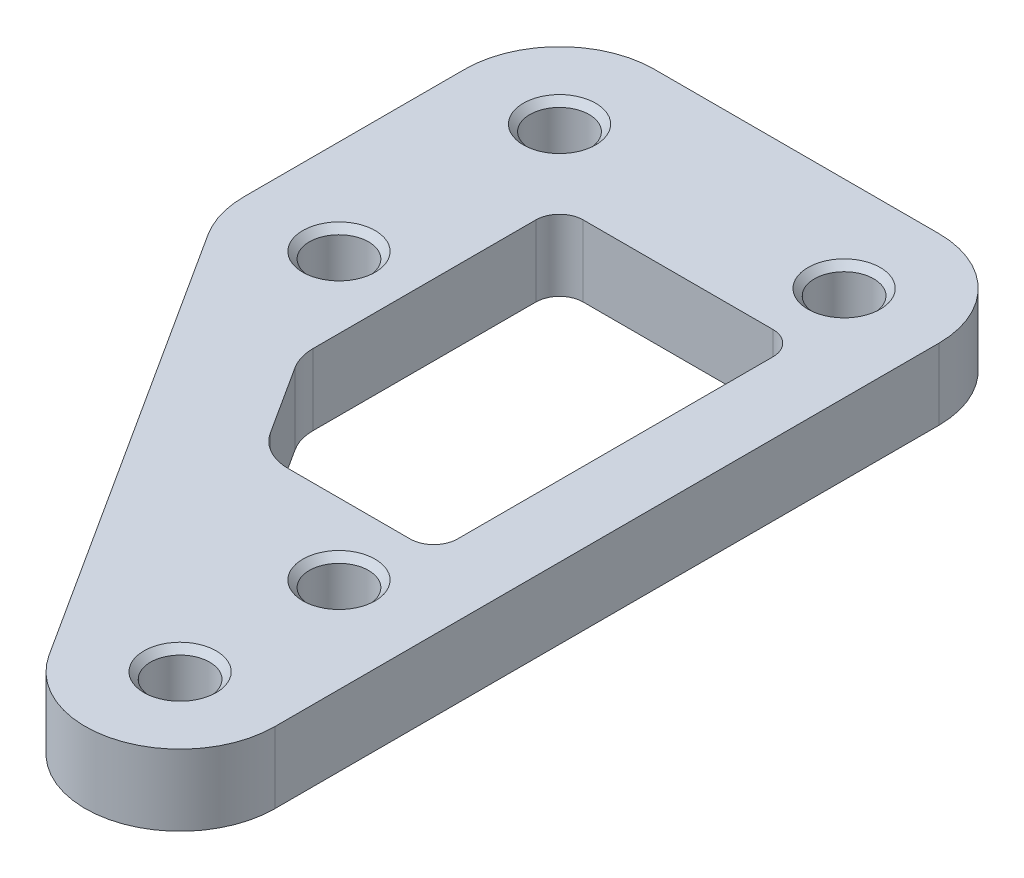
ISO-10303-21;
HEADER;
FILE_DESCRIPTION(('STEP AP214'),'2;1');
FILE_NAME('part.step','',(''),(''),'','','');
FILE_SCHEMA(('AUTOMOTIVE_DESIGN { 1 0 10303 214 1 1 1 1 }'));
ENDSEC;
DATA;
#1=APPLICATION_CONTEXT('core data for automotive mechanical design processes');
#2=APPLICATION_PROTOCOL_DEFINITION('international standard','automotive_design',2000,#1);
#3=PRODUCT_CONTEXT('',#1,'mechanical');
#4=PRODUCT('Part','Part','',(#3));
#5=PRODUCT_RELATED_PRODUCT_CATEGORY('part','',(#4));
#6=PRODUCT_DEFINITION_FORMATION('','',#4);
#7=PRODUCT_DEFINITION_CONTEXT('part definition',#1,'design');
#8=PRODUCT_DEFINITION('design','',#6,#7);
#9=PRODUCT_DEFINITION_SHAPE('','',#8);
#10=(LENGTH_UNIT() NAMED_UNIT(*) SI_UNIT(.MILLI.,.METRE.));
#11=(NAMED_UNIT(*) PLANE_ANGLE_UNIT() SI_UNIT($,.RADIAN.));
#12=(NAMED_UNIT(*) SI_UNIT($,.STERADIAN.) SOLID_ANGLE_UNIT());
#13=UNCERTAINTY_MEASURE_WITH_UNIT(LENGTH_MEASURE(1.E-05),#10,'distance_accuracy_value','');
#14=(GEOMETRIC_REPRESENTATION_CONTEXT(3) GLOBAL_UNCERTAINTY_ASSIGNED_CONTEXT((#13)) GLOBAL_UNIT_ASSIGNED_CONTEXT((#10,
#11,#12)) REPRESENTATION_CONTEXT('',''));
#15=CARTESIAN_POINT('',(0.,0.,0.));
#16=DIRECTION('',(0.,0.,1.));
#17=DIRECTION('',(1.,0.,0.));
#18=AXIS2_PLACEMENT_3D('',#15,#16,#17);
#19=CARTESIAN_POINT('',(-12.,3.,9.3));
#20=DIRECTION('',(0.,-1.,0.));
#21=DIRECTION('',(0.,0.,-1.));
#22=AXIS2_PLACEMENT_3D('',#19,#20,#21);
#23=PLANE('',#22);
#24=CARTESIAN_POINT('',(-12.,3.,0.));
#25=DIRECTION('',(0.,1.,0.));
#26=DIRECTION('',(0.,0.,1.));
#27=AXIS2_PLACEMENT_3D('',#24,#25,#26);
#28=CIRCLE('',#27,1.525);
#29=CARTESIAN_POINT('',(-12.,3.,1.525));
#30=VERTEX_POINT('',#29);
#31=EDGE_CURVE('E444',#30,#30,#28,.T.);
#32=ORIENTED_EDGE('',*,*,#31,.F.);
#33=EDGE_LOOP('',(#32));
#34=FACE_BOUND('',#33,.T.);
#35=CARTESIAN_POINT('',(-12.,3.,9.3));
#36=DIRECTION('',(0.,1.,0.));
#37=DIRECTION('',(0.,0.,1.));
#38=AXIS2_PLACEMENT_3D('',#35,#36,#37);
#39=CIRCLE('',#38,1.525);
#40=CARTESIAN_POINT('',(-12.,3.,10.825));
#41=VERTEX_POINT('',#40);
#42=EDGE_CURVE('E451',#41,#41,#39,.T.);
#43=ORIENTED_EDGE('',*,*,#42,.F.);
#44=EDGE_LOOP('',(#43));
#45=FACE_BOUND('',#44,.T.);
#46=CARTESIAN_POINT('',(0.,3.,0.));
#47=DIRECTION('',(0.,1.,0.));
#48=DIRECTION('',(0.,0.,1.));
#49=AXIS2_PLACEMENT_3D('',#46,#47,#48);
#50=CIRCLE('',#49,1.525);
#51=CARTESIAN_POINT('',(0.,3.,1.525));
#52=VERTEX_POINT('',#51);
#53=EDGE_CURVE('E460',#52,#52,#50,.T.);
#54=ORIENTED_EDGE('',*,*,#53,.F.);
#55=EDGE_LOOP('',(#54));
#56=FACE_BOUND('',#55,.T.);
#57=CARTESIAN_POINT('',(0.,3.,21.3));
#58=DIRECTION('',(0.,1.,0.));
#59=DIRECTION('',(0.,0.,1.));
#60=AXIS2_PLACEMENT_3D('',#57,#58,#59);
#61=CIRCLE('',#60,1.525);
#62=CARTESIAN_POINT('',(0.,3.,22.825));
#63=VERTEX_POINT('',#62);
#64=EDGE_CURVE('E469',#63,#63,#61,.T.);
#65=ORIENTED_EDGE('',*,*,#64,.F.);
#66=EDGE_LOOP('',(#65));
#67=FACE_BOUND('',#66,.T.);
#68=CARTESIAN_POINT('',(0.,3.,28.));
#69=DIRECTION('',(0.,1.,0.));
#70=DIRECTION('',(0.,0.,1.));
#71=AXIS2_PLACEMENT_3D('',#68,#69,#70);
#72=CIRCLE('',#71,1.525);
#73=CARTESIAN_POINT('',(0.,3.,29.525));
#74=VERTEX_POINT('',#73);
#75=EDGE_CURVE('E478',#74,#74,#72,.T.);
#76=ORIENTED_EDGE('',*,*,#75,.F.);
#77=EDGE_LOOP('',(#76));
#78=FACE_BOUND('',#77,.T.);
#79=CARTESIAN_POINT('',(-12.,3.,9.3));
#80=DIRECTION('',(0.,1.,0.));
#81=DIRECTION('',(0.,0.,-1.));
#82=AXIS2_PLACEMENT_3D('',#79,#80,#81);
#83=CIRCLE('',#82,4.);
#84=CARTESIAN_POINT('',(-16.,3.,9.3));
#85=VERTEX_POINT('',#84);
#86=CARTESIAN_POINT('',(-15.3664675506489,3.,11.460300032502));
#87=VERTEX_POINT('',#86);
#88=EDGE_CURVE('E244',#85,#87,#83,.T.);
#89=ORIENTED_EDGE('',*,*,#88,.T.);
#90=DIRECTION('',(0.540075008125492,0.,0.841616887662225));
#91=VECTOR('',#90,1.);
#92=CARTESIAN_POINT('',(-15.3664675506489,3.,11.460300032502));
#93=LINE('',#92,#91);
#94=CARTESIAN_POINT('',(-3.3664675506489,3.,30.160300032502));
#95=VERTEX_POINT('',#94);
#96=EDGE_CURVE('E247',#87,#95,#93,.T.);
#97=ORIENTED_EDGE('',*,*,#96,.T.);
#98=CARTESIAN_POINT('',(0.,3.,28.));
#99=DIRECTION('',(0.,1.,0.));
#100=DIRECTION('',(0.,0.,1.));
#101=AXIS2_PLACEMENT_3D('',#98,#99,#100);
#102=CIRCLE('',#101,4.);
#103=CARTESIAN_POINT('',(4.,3.,28.));
#104=VERTEX_POINT('',#103);
#105=EDGE_CURVE('E250',#95,#104,#102,.T.);
#106=ORIENTED_EDGE('',*,*,#105,.T.);
#107=DIRECTION('',(0.,0.,-1.));
#108=VECTOR('',#107,1.);
#109=CARTESIAN_POINT('',(4.,3.,28.));
#110=LINE('',#109,#108);
#111=CARTESIAN_POINT('',(4.,3.,0.));
#112=VERTEX_POINT('',#111);
#113=EDGE_CURVE('E252',#104,#112,#110,.T.);
#114=ORIENTED_EDGE('',*,*,#113,.T.);
#115=CARTESIAN_POINT('',(0.,3.,0.));
#116=DIRECTION('',(0.,1.,0.));
#117=DIRECTION('',(0.,0.,-1.));
#118=AXIS2_PLACEMENT_3D('',#115,#116,#117);
#119=CIRCLE('',#118,4.);
#120=CARTESIAN_POINT('',(0.,3.,-4.));
#121=VERTEX_POINT('',#120);
#122=EDGE_CURVE('E254',#112,#121,#119,.T.);
#123=ORIENTED_EDGE('',*,*,#122,.T.);
#124=DIRECTION('',(-1.,0.,0.));
#125=VECTOR('',#124,1.);
#126=CARTESIAN_POINT('',(0.,3.,-4.));
#127=LINE('',#126,#125);
#128=CARTESIAN_POINT('',(-12.,3.,-3.99999999999999));
#129=VERTEX_POINT('',#128);
#130=EDGE_CURVE('E256',#121,#129,#127,.T.);
#131=ORIENTED_EDGE('',*,*,#130,.T.);
#132=CARTESIAN_POINT('',(-12.,3.,0.));
#133=DIRECTION('',(0.,1.,0.));
#134=DIRECTION('',(0.,0.,1.));
#135=AXIS2_PLACEMENT_3D('',#132,#133,#134);
#136=CIRCLE('',#135,3.99999999999999);
#137=CARTESIAN_POINT('',(-16.,3.,0.));
#138=VERTEX_POINT('',#137);
#139=EDGE_CURVE('E258',#129,#138,#136,.T.);
#140=ORIENTED_EDGE('',*,*,#139,.T.);
#141=DIRECTION('',(0.,0.,1.));
#142=VECTOR('',#141,1.);
#143=CARTESIAN_POINT('',(-16.,3.,0.));
#144=LINE('',#143,#142);
#145=EDGE_CURVE('E260',#138,#85,#144,.T.);
#146=ORIENTED_EDGE('',*,*,#145,.T.);
#147=EDGE_LOOP('',(#89,#97,#106,#114,#123,#131,#140,#146));
#148=FACE_BOUND('',#147,.T.);
#149=CARTESIAN_POINT('',(0.,3.,17.3));
#150=DIRECTION('',(0.,1.,0.));
#151=DIRECTION('',(0.,0.,1.));
#152=AXIS2_PLACEMENT_3D('',#149,#150,#151);
#153=CIRCLE('',#152,1.);
#154=CARTESIAN_POINT('',(0.,3.,18.3));
#155=VERTEX_POINT('',#154);
#156=CARTESIAN_POINT('',(0.999999999999998,3.,17.3));
#157=VERTEX_POINT('',#156);
#158=EDGE_CURVE('E163',#155,#157,#153,.T.);
#159=ORIENTED_EDGE('',*,*,#158,.F.);
#160=DIRECTION('',(1.,0.,0.));
#161=VECTOR('',#160,1.);
#162=CARTESIAN_POINT('',(0.,3.,18.3));
#163=LINE('',#162,#161);
#164=CARTESIAN_POINT('',(-5.1316432195947,3.,18.3));
#165=VERTEX_POINT('',#164);
#166=EDGE_CURVE('E201',#165,#155,#163,.T.);
#167=ORIENTED_EDGE('',*,*,#166,.F.);
#168=CARTESIAN_POINT('',(-5.1316432195947,3.,16.3));
#169=DIRECTION('',(0.,1.,0.));
#170=DIRECTION('',(0.,0.,1.));
#171=AXIS2_PLACEMENT_3D('',#168,#169,#170);
#172=CIRCLE('',#171,2.);
#173=CARTESIAN_POINT('',(-6.81487699491915,3.,17.380150016251));
#174=VERTEX_POINT('',#173);
#175=EDGE_CURVE('E199',#174,#165,#172,.T.);
#176=ORIENTED_EDGE('',*,*,#175,.F.);
#177=DIRECTION('',(0.540075008125492,0.,0.841616887662225));
#178=VECTOR('',#177,1.);
#179=CARTESIAN_POINT('',(-8.68323377532445,3.,14.4686273667861));
#180=LINE('',#179,#178);
#181=CARTESIAN_POINT('',(-8.68323377532445,3.,14.4686273667861));
#182=VERTEX_POINT('',#181);
#183=EDGE_CURVE('E197',#182,#174,#180,.T.);
#184=ORIENTED_EDGE('',*,*,#183,.F.);
#185=CARTESIAN_POINT('',(-7.,3.,13.3884773505351));
#186=DIRECTION('',(0.,1.,0.));
#187=DIRECTION('',(0.,0.,1.));
#188=AXIS2_PLACEMENT_3D('',#185,#186,#187);
#189=CIRCLE('',#188,2.);
#190=CARTESIAN_POINT('',(-9.,3.,13.3884773505351));
#191=VERTEX_POINT('',#190);
#192=EDGE_CURVE('E195',#191,#182,#189,.T.);
#193=ORIENTED_EDGE('',*,*,#192,.F.);
#194=DIRECTION('',(0.,0.,1.));
#195=VECTOR('',#194,1.);
#196=CARTESIAN_POINT('',(-9.,3.,4.00000000000001));
#197=LINE('',#196,#195);
#198=CARTESIAN_POINT('',(-9.,3.,4.00000000000001));
#199=VERTEX_POINT('',#198);
#200=EDGE_CURVE('E193',#199,#191,#197,.T.);
#201=ORIENTED_EDGE('',*,*,#200,.F.);
#202=CARTESIAN_POINT('',(-8.,3.,4.));
#203=DIRECTION('',(0.,1.,0.));
#204=DIRECTION('',(0.,0.,1.));
#205=AXIS2_PLACEMENT_3D('',#202,#203,#204);
#206=CIRCLE('',#205,1.);
#207=CARTESIAN_POINT('',(-7.99999999999999,3.,3.));
#208=VERTEX_POINT('',#207);
#209=EDGE_CURVE('E191',#208,#199,#206,.T.);
#210=ORIENTED_EDGE('',*,*,#209,.F.);
#211=DIRECTION('',(-1.,0.,0.));
#212=VECTOR('',#211,1.);
#213=CARTESIAN_POINT('',(-7.99999999999999,3.,3.));
#214=LINE('',#213,#212);
#215=CARTESIAN_POINT('',(0.,3.,3.));
#216=VERTEX_POINT('',#215);
#217=EDGE_CURVE('E186',#216,#208,#214,.T.);
#218=ORIENTED_EDGE('',*,*,#217,.F.);
#219=CARTESIAN_POINT('',(0.,3.,4.));
#220=DIRECTION('',(0.,1.,0.));
#221=DIRECTION('',(0.,0.,-1.));
#222=AXIS2_PLACEMENT_3D('',#219,#220,#221);
#223=CIRCLE('',#222,1.);
#224=CARTESIAN_POINT('',(0.999999999999998,3.,4.00000000000001));
#225=VERTEX_POINT('',#224);
#226=EDGE_CURVE('E184',#225,#216,#223,.T.);
#227=ORIENTED_EDGE('',*,*,#226,.F.);
#228=DIRECTION('',(0.,0.,-1.));
#229=VECTOR('',#228,1.);
#230=CARTESIAN_POINT('',(0.999999999999997,3.,4.00000000000001));
#231=LINE('',#230,#229);
#232=EDGE_CURVE('E171',#157,#225,#231,.T.);
#233=ORIENTED_EDGE('',*,*,#232,.F.);
#234=EDGE_LOOP('',(#159,#167,#176,#184,#193,#201,#210,#218,#227,#233));
#235=FACE_BOUND('',#234,.T.);
#236=ADVANCED_FACE('F38',(#34,#45,#56,#67,#78,#148,#235),#23,.F.);
#237=CARTESIAN_POINT('',(-12.,0.,9.3));
#238=DIRECTION('',(0.,-1.,0.));
#239=DIRECTION('',(0.,0.,-1.));
#240=AXIS2_PLACEMENT_3D('',#237,#238,#239);
#241=PLANE('',#240);
#242=CARTESIAN_POINT('',(-12.,0.,0.));
#243=DIRECTION('',(0.,1.,0.));
#244=DIRECTION('',(0.,0.,1.));
#245=AXIS2_PLACEMENT_3D('',#242,#243,#244);
#246=CIRCLE('',#245,1.25);
#247=CARTESIAN_POINT('',(-12.,0.,1.25));
#248=VERTEX_POINT('',#247);
#249=EDGE_CURVE('E446',#248,#248,#246,.T.);
#250=ORIENTED_EDGE('',*,*,#249,.T.);
#251=EDGE_LOOP('',(#250));
#252=FACE_BOUND('',#251,.T.);
#253=CARTESIAN_POINT('',(-12.,0.,9.3));
#254=DIRECTION('',(0.,1.,0.));
#255=DIRECTION('',(0.,0.,1.));
#256=AXIS2_PLACEMENT_3D('',#253,#254,#255);
#257=CIRCLE('',#256,1.25);
#258=CARTESIAN_POINT('',(-12.,0.,10.55));
#259=VERTEX_POINT('',#258);
#260=EDGE_CURVE('E457',#259,#259,#257,.T.);
#261=ORIENTED_EDGE('',*,*,#260,.T.);
#262=EDGE_LOOP('',(#261));
#263=FACE_BOUND('',#262,.T.);
#264=CARTESIAN_POINT('',(0.,0.,0.));
#265=DIRECTION('',(0.,1.,0.));
#266=DIRECTION('',(0.,0.,1.));
#267=AXIS2_PLACEMENT_3D('',#264,#265,#266);
#268=CIRCLE('',#267,1.25);
#269=CARTESIAN_POINT('',(0.,0.,1.25));
#270=VERTEX_POINT('',#269);
#271=EDGE_CURVE('E466',#270,#270,#268,.T.);
#272=ORIENTED_EDGE('',*,*,#271,.T.);
#273=EDGE_LOOP('',(#272));
#274=FACE_BOUND('',#273,.T.);
#275=CARTESIAN_POINT('',(0.,0.,21.3));
#276=DIRECTION('',(0.,1.,0.));
#277=DIRECTION('',(0.,0.,1.));
#278=AXIS2_PLACEMENT_3D('',#275,#276,#277);
#279=CIRCLE('',#278,1.25);
#280=CARTESIAN_POINT('',(0.,0.,22.55));
#281=VERTEX_POINT('',#280);
#282=EDGE_CURVE('E475',#281,#281,#279,.T.);
#283=ORIENTED_EDGE('',*,*,#282,.T.);
#284=EDGE_LOOP('',(#283));
#285=FACE_BOUND('',#284,.T.);
#286=CARTESIAN_POINT('',(0.,0.,28.));
#287=DIRECTION('',(0.,1.,0.));
#288=DIRECTION('',(0.,0.,1.));
#289=AXIS2_PLACEMENT_3D('',#286,#287,#288);
#290=CIRCLE('',#289,1.25);
#291=CARTESIAN_POINT('',(0.,0.,29.25));
#292=VERTEX_POINT('',#291);
#293=EDGE_CURVE('E204',#292,#292,#290,.T.);
#294=ORIENTED_EDGE('',*,*,#293,.T.);
#295=EDGE_LOOP('',(#294));
#296=FACE_BOUND('',#295,.T.);
#297=CARTESIAN_POINT('',(-12.,0.,9.3));
#298=DIRECTION('',(0.,1.,0.));
#299=DIRECTION('',(0.,0.,-1.));
#300=AXIS2_PLACEMENT_3D('',#297,#298,#299);
#301=CIRCLE('',#300,4.);
#302=CARTESIAN_POINT('',(-16.,0.,9.3));
#303=VERTEX_POINT('',#302);
#304=CARTESIAN_POINT('',(-15.3664675506489,0.,11.460300032502));
#305=VERTEX_POINT('',#304);
#306=EDGE_CURVE('E179',#303,#305,#301,.T.);
#307=ORIENTED_EDGE('',*,*,#306,.F.);
#308=DIRECTION('',(0.,0.,1.));
#309=VECTOR('',#308,1.);
#310=CARTESIAN_POINT('',(-16.,0.,0.));
#311=LINE('',#310,#309);
#312=CARTESIAN_POINT('',(-16.,0.,0.));
#313=VERTEX_POINT('',#312);
#314=EDGE_CURVE('E248',#313,#303,#311,.T.);
#315=ORIENTED_EDGE('',*,*,#314,.F.);
#316=CARTESIAN_POINT('',(-12.,0.,0.));
#317=DIRECTION('',(0.,1.,0.));
#318=DIRECTION('',(0.,0.,1.));
#319=AXIS2_PLACEMENT_3D('',#316,#317,#318);
#320=CIRCLE('',#319,3.99999999999999);
#321=CARTESIAN_POINT('',(-12.,0.,-3.99999999999999));
#322=VERTEX_POINT('',#321);
#323=EDGE_CURVE('E275',#322,#313,#320,.T.);
#324=ORIENTED_EDGE('',*,*,#323,.F.);
#325=DIRECTION('',(-1.,0.,0.));
#326=VECTOR('',#325,1.);
#327=CARTESIAN_POINT('',(0.,0.,-4.));
#328=LINE('',#327,#326);
#329=CARTESIAN_POINT('',(0.,0.,-4.));
#330=VERTEX_POINT('',#329);
#331=EDGE_CURVE('E273',#330,#322,#328,.T.);
#332=ORIENTED_EDGE('',*,*,#331,.F.);
#333=CARTESIAN_POINT('',(0.,0.,0.));
#334=DIRECTION('',(0.,1.,0.));
#335=DIRECTION('',(0.,0.,-1.));
#336=AXIS2_PLACEMENT_3D('',#333,#334,#335);
#337=CIRCLE('',#336,4.);
#338=CARTESIAN_POINT('',(4.,0.,0.));
#339=VERTEX_POINT('',#338);
#340=EDGE_CURVE('E271',#339,#330,#337,.T.);
#341=ORIENTED_EDGE('',*,*,#340,.F.);
#342=DIRECTION('',(0.,0.,-1.));
#343=VECTOR('',#342,1.);
#344=CARTESIAN_POINT('',(4.,0.,28.));
#345=LINE('',#344,#343);
#346=CARTESIAN_POINT('',(4.,0.,28.));
#347=VERTEX_POINT('',#346);
#348=EDGE_CURVE('E269',#347,#339,#345,.T.);
#349=ORIENTED_EDGE('',*,*,#348,.F.);
#350=CARTESIAN_POINT('',(0.,0.,28.));
#351=DIRECTION('',(0.,1.,0.));
#352=DIRECTION('',(0.,0.,1.));
#353=AXIS2_PLACEMENT_3D('',#350,#351,#352);
#354=CIRCLE('',#353,4.);
#355=CARTESIAN_POINT('',(-3.3664675506489,0.,30.160300032502));
#356=VERTEX_POINT('',#355);
#357=EDGE_CURVE('E267',#356,#347,#354,.T.);
#358=ORIENTED_EDGE('',*,*,#357,.F.);
#359=DIRECTION('',(0.540075008125492,0.,0.841616887662225));
#360=VECTOR('',#359,1.);
#361=CARTESIAN_POINT('',(-15.3664675506489,0.,11.460300032502));
#362=LINE('',#361,#360);
#363=EDGE_CURVE('E265',#305,#356,#362,.T.);
#364=ORIENTED_EDGE('',*,*,#363,.F.);
#365=EDGE_LOOP('',(#307,#315,#324,#332,#341,#349,#358,#364));
#366=FACE_BOUND('',#365,.T.);
#367=DIRECTION('',(1.,0.,0.));
#368=VECTOR('',#367,1.);
#369=CARTESIAN_POINT('',(0.,0.,18.3));
#370=LINE('',#369,#368);
#371=CARTESIAN_POINT('',(-5.1316432195947,0.,18.3));
#372=VERTEX_POINT('',#371);
#373=CARTESIAN_POINT('',(0.,0.,18.3));
#374=VERTEX_POINT('',#373);
#375=EDGE_CURVE('E172',#372,#374,#370,.T.);
#376=ORIENTED_EDGE('',*,*,#375,.T.);
#377=CARTESIAN_POINT('',(0.,0.,17.3));
#378=DIRECTION('',(0.,1.,0.));
#379=DIRECTION('',(0.,0.,1.));
#380=AXIS2_PLACEMENT_3D('',#377,#378,#379);
#381=CIRCLE('',#380,1.);
#382=CARTESIAN_POINT('',(0.999999999999998,0.,17.3));
#383=VERTEX_POINT('',#382);
#384=EDGE_CURVE('E61',#374,#383,#381,.T.);
#385=ORIENTED_EDGE('',*,*,#384,.T.);
#386=DIRECTION('',(0.,0.,-1.));
#387=VECTOR('',#386,1.);
#388=CARTESIAN_POINT('',(0.999999999999997,0.,4.00000000000001));
#389=LINE('',#388,#387);
#390=CARTESIAN_POINT('',(0.999999999999998,0.,4.00000000000001));
#391=VERTEX_POINT('',#390);
#392=EDGE_CURVE('E178',#383,#391,#389,.T.);
#393=ORIENTED_EDGE('',*,*,#392,.T.);
#394=CARTESIAN_POINT('',(0.,0.,4.));
#395=DIRECTION('',(0.,1.,0.));
#396=DIRECTION('',(0.,0.,-1.));
#397=AXIS2_PLACEMENT_3D('',#394,#395,#396);
#398=CIRCLE('',#397,1.);
#399=CARTESIAN_POINT('',(0.,0.,3.));
#400=VERTEX_POINT('',#399);
#401=EDGE_CURVE('E206',#391,#400,#398,.T.);
#402=ORIENTED_EDGE('',*,*,#401,.T.);
#403=DIRECTION('',(-1.,0.,0.));
#404=VECTOR('',#403,1.);
#405=CARTESIAN_POINT('',(-7.99999999999999,0.,3.));
#406=LINE('',#405,#404);
#407=CARTESIAN_POINT('',(-7.99999999999999,0.,3.));
#408=VERTEX_POINT('',#407);
#409=EDGE_CURVE('E209',#400,#408,#406,.T.);
#410=ORIENTED_EDGE('',*,*,#409,.T.);
#411=CARTESIAN_POINT('',(-8.,0.,4.));
#412=DIRECTION('',(0.,1.,0.));
#413=DIRECTION('',(0.,0.,1.));
#414=AXIS2_PLACEMENT_3D('',#411,#412,#413);
#415=CIRCLE('',#414,1.);
#416=CARTESIAN_POINT('',(-9.,0.,4.00000000000001));
#417=VERTEX_POINT('',#416);
#418=EDGE_CURVE('E212',#408,#417,#415,.T.);
#419=ORIENTED_EDGE('',*,*,#418,.T.);
#420=DIRECTION('',(0.,0.,1.));
#421=VECTOR('',#420,1.);
#422=CARTESIAN_POINT('',(-9.,0.,4.00000000000001));
#423=LINE('',#422,#421);
#424=CARTESIAN_POINT('',(-9.,0.,13.3884773505351));
#425=VERTEX_POINT('',#424);
#426=EDGE_CURVE('E215',#417,#425,#423,.T.);
#427=ORIENTED_EDGE('',*,*,#426,.T.);
#428=CARTESIAN_POINT('',(-7.,0.,13.3884773505351));
#429=DIRECTION('',(0.,1.,0.));
#430=DIRECTION('',(0.,0.,1.));
#431=AXIS2_PLACEMENT_3D('',#428,#429,#430);
#432=CIRCLE('',#431,2.);
#433=CARTESIAN_POINT('',(-8.68323377532445,0.,14.4686273667861));
#434=VERTEX_POINT('',#433);
#435=EDGE_CURVE('E218',#425,#434,#432,.T.);
#436=ORIENTED_EDGE('',*,*,#435,.T.);
#437=DIRECTION('',(0.540075008125492,0.,0.841616887662225));
#438=VECTOR('',#437,1.);
#439=CARTESIAN_POINT('',(-8.68323377532445,0.,14.4686273667861));
#440=LINE('',#439,#438);
#441=CARTESIAN_POINT('',(-6.81487699491915,0.,17.380150016251));
#442=VERTEX_POINT('',#441);
#443=EDGE_CURVE('E221',#434,#442,#440,.T.);
#444=ORIENTED_EDGE('',*,*,#443,.T.);
#445=CARTESIAN_POINT('',(-5.1316432195947,0.,16.3));
#446=DIRECTION('',(0.,1.,0.));
#447=DIRECTION('',(0.,0.,1.));
#448=AXIS2_PLACEMENT_3D('',#445,#446,#447);
#449=CIRCLE('',#448,2.);
#450=EDGE_CURVE('E224',#442,#372,#449,.T.);
#451=ORIENTED_EDGE('',*,*,#450,.T.);
#452=EDGE_LOOP('',(#376,#385,#393,#402,#410,#419,#427,#436,#444,#451));
#453=FACE_BOUND('',#452,.T.);
#454=ADVANCED_FACE('F305',(#252,#263,#274,#285,#296,#366,#453),#241,.T.);
#455=CARTESIAN_POINT('',(-12.,3.,9.3));
#456=DIRECTION('',(0.,-1.,0.));
#457=DIRECTION('',(0.,0.,-1.));
#458=AXIS2_PLACEMENT_3D('',#455,#456,#457);
#459=CYLINDRICAL_SURFACE('',#458,4.);
#460=ORIENTED_EDGE('',*,*,#306,.T.);
#461=DIRECTION('',(0.,-1.,0.));
#462=VECTOR('',#461,1.);
#463=CARTESIAN_POINT('',(-15.3664675506489,3.,11.460300032502));
#464=LINE('',#463,#462);
#465=EDGE_CURVE('E11',#87,#305,#464,.T.);
#466=ORIENTED_EDGE('',*,*,#465,.F.);
#467=ORIENTED_EDGE('',*,*,#88,.F.);
#468=DIRECTION('',(0.,-1.,0.));
#469=VECTOR('',#468,1.);
#470=CARTESIAN_POINT('',(-16.,3.,9.3));
#471=LINE('',#470,#469);
#472=EDGE_CURVE('E262',#85,#303,#471,.T.);
#473=ORIENTED_EDGE('',*,*,#472,.T.);
#474=EDGE_LOOP('',(#460,#466,#467,#473));
#475=FACE_BOUND('',#474,.T.);
#476=ADVANCED_FACE('F40',(#475),#459,.T.);
#477=CARTESIAN_POINT('',(-15.3664675506489,3.,11.460300032502));
#478=DIRECTION('',(0.841616887662225,0.,-0.540075008125492));
#479=DIRECTION('',(-0.540075008125492,0.,-0.841616887662225));
#480=AXIS2_PLACEMENT_3D('',#477,#478,#479);
#481=PLANE('',#480);
#482=ORIENTED_EDGE('',*,*,#363,.T.);
#483=DIRECTION('',(0.,-1.,0.));
#484=VECTOR('',#483,1.);
#485=CARTESIAN_POINT('',(-3.3664675506489,3.,30.160300032502));
#486=LINE('',#485,#484);
#487=EDGE_CURVE('E46',#95,#356,#486,.T.);
#488=ORIENTED_EDGE('',*,*,#487,.F.);
#489=ORIENTED_EDGE('',*,*,#96,.F.);
#490=ORIENTED_EDGE('',*,*,#465,.T.);
#491=EDGE_LOOP('',(#482,#488,#489,#490));
#492=FACE_BOUND('',#491,.T.);
#493=ADVANCED_FACE('F322',(#492),#481,.F.);
#494=CARTESIAN_POINT('',(0.,3.,28.));
#495=DIRECTION('',(0.,-1.,0.));
#496=DIRECTION('',(0.,0.,-1.));
#497=AXIS2_PLACEMENT_3D('',#494,#495,#496);
#498=CYLINDRICAL_SURFACE('',#497,4.);
#499=ORIENTED_EDGE('',*,*,#357,.T.);
#500=DIRECTION('',(0.,-1.,0.));
#501=VECTOR('',#500,1.);
#502=CARTESIAN_POINT('',(4.,3.,28.));
#503=LINE('',#502,#501);
#504=EDGE_CURVE('E292',#104,#347,#503,.T.);
#505=ORIENTED_EDGE('',*,*,#504,.F.);
#506=ORIENTED_EDGE('',*,*,#105,.F.);
#507=ORIENTED_EDGE('',*,*,#487,.T.);
#508=EDGE_LOOP('',(#499,#505,#506,#507));
#509=FACE_BOUND('',#508,.T.);
#510=ADVANCED_FACE('F299',(#509),#498,.T.);
#511=CARTESIAN_POINT('',(4.,3.,28.));
#512=DIRECTION('',(-1.,0.,0.));
#513=DIRECTION('',(0.,0.,1.));
#514=AXIS2_PLACEMENT_3D('',#511,#512,#513);
#515=PLANE('',#514);
#516=ORIENTED_EDGE('',*,*,#348,.T.);
#517=DIRECTION('',(0.,-1.,0.));
#518=VECTOR('',#517,1.);
#519=CARTESIAN_POINT('',(4.,3.,0.));
#520=LINE('',#519,#518);
#521=EDGE_CURVE('E289',#112,#339,#520,.T.);
#522=ORIENTED_EDGE('',*,*,#521,.F.);
#523=ORIENTED_EDGE('',*,*,#113,.F.);
#524=ORIENTED_EDGE('',*,*,#504,.T.);
#525=EDGE_LOOP('',(#516,#522,#523,#524));
#526=FACE_BOUND('',#525,.T.);
#527=ADVANCED_FACE('F311',(#526),#515,.F.);
#528=CARTESIAN_POINT('',(0.,3.,0.));
#529=DIRECTION('',(0.,-1.,0.));
#530=DIRECTION('',(0.,0.,-1.));
#531=AXIS2_PLACEMENT_3D('',#528,#529,#530);
#532=CYLINDRICAL_SURFACE('',#531,4.);
#533=ORIENTED_EDGE('',*,*,#340,.T.);
#534=DIRECTION('',(0.,-1.,0.));
#535=VECTOR('',#534,1.);
#536=CARTESIAN_POINT('',(0.,3.,-4.));
#537=LINE('',#536,#535);
#538=EDGE_CURVE('E286',#121,#330,#537,.T.);
#539=ORIENTED_EDGE('',*,*,#538,.F.);
#540=ORIENTED_EDGE('',*,*,#122,.F.);
#541=ORIENTED_EDGE('',*,*,#521,.T.);
#542=EDGE_LOOP('',(#533,#539,#540,#541));
#543=FACE_BOUND('',#542,.T.);
#544=ADVANCED_FACE('F315',(#543),#532,.T.);
#545=CARTESIAN_POINT('',(0.,3.,-4.));
#546=DIRECTION('',(0.,0.,1.));
#547=DIRECTION('',(1.,0.,0.));
#548=AXIS2_PLACEMENT_3D('',#545,#546,#547);
#549=PLANE('',#548);
#550=ORIENTED_EDGE('',*,*,#331,.T.);
#551=DIRECTION('',(0.,-1.,0.));
#552=VECTOR('',#551,1.);
#553=CARTESIAN_POINT('',(-12.,3.,-3.99999999999999));
#554=LINE('',#553,#552);
#555=EDGE_CURVE('E283',#129,#322,#554,.T.);
#556=ORIENTED_EDGE('',*,*,#555,.F.);
#557=ORIENTED_EDGE('',*,*,#130,.F.);
#558=ORIENTED_EDGE('',*,*,#538,.T.);
#559=EDGE_LOOP('',(#550,#556,#557,#558));
#560=FACE_BOUND('',#559,.T.);
#561=ADVANCED_FACE('F335',(#560),#549,.F.);
#562=CARTESIAN_POINT('',(-12.,3.,0.));
#563=DIRECTION('',(0.,-1.,0.));
#564=DIRECTION('',(0.,0.,-1.));
#565=AXIS2_PLACEMENT_3D('',#562,#563,#564);
#566=CYLINDRICAL_SURFACE('',#565,3.99999999999999);
#567=ORIENTED_EDGE('',*,*,#323,.T.);
#568=DIRECTION('',(0.,-1.,0.));
#569=VECTOR('',#568,1.);
#570=CARTESIAN_POINT('',(-16.,3.,0.));
#571=LINE('',#570,#569);
#572=EDGE_CURVE('E280',#138,#313,#571,.T.);
#573=ORIENTED_EDGE('',*,*,#572,.F.);
#574=ORIENTED_EDGE('',*,*,#139,.F.);
#575=ORIENTED_EDGE('',*,*,#555,.T.);
#576=EDGE_LOOP('',(#567,#573,#574,#575));
#577=FACE_BOUND('',#576,.T.);
#578=ADVANCED_FACE('F333',(#577),#566,.T.);
#579=CARTESIAN_POINT('',(-16.,3.,0.));
#580=DIRECTION('',(1.,0.,0.));
#581=DIRECTION('',(0.,0.,-1.));
#582=AXIS2_PLACEMENT_3D('',#579,#580,#581);
#583=PLANE('',#582);
#584=ORIENTED_EDGE('',*,*,#314,.T.);
#585=ORIENTED_EDGE('',*,*,#472,.F.);
#586=ORIENTED_EDGE('',*,*,#145,.F.);
#587=ORIENTED_EDGE('',*,*,#572,.T.);
#588=EDGE_LOOP('',(#584,#585,#586,#587));
#589=FACE_BOUND('',#588,.T.);
#590=ADVANCED_FACE('F328',(#589),#583,.F.);
#591=CARTESIAN_POINT('',(0.,3.,17.3));
#592=DIRECTION('',(0.,-1.,0.));
#593=DIRECTION('',(0.,0.,-1.));
#594=AXIS2_PLACEMENT_3D('',#591,#592,#593);
#595=CYLINDRICAL_SURFACE('',#594,1.);
#596=ORIENTED_EDGE('',*,*,#384,.F.);
#597=DIRECTION('',(0.,-1.,0.));
#598=VECTOR('',#597,1.);
#599=CARTESIAN_POINT('',(0.,3.,18.3));
#600=LINE('',#599,#598);
#601=EDGE_CURVE('E167',#155,#374,#600,.T.);
#602=ORIENTED_EDGE('',*,*,#601,.F.);
#603=ORIENTED_EDGE('',*,*,#158,.T.);
#604=DIRECTION('',(0.,-1.,0.));
#605=VECTOR('',#604,1.);
#606=CARTESIAN_POINT('',(0.999999999999998,3.,17.3));
#607=LINE('',#606,#605);
#608=EDGE_CURVE('E166',#157,#383,#607,.T.);
#609=ORIENTED_EDGE('',*,*,#608,.T.);
#610=EDGE_LOOP('',(#596,#602,#603,#609));
#611=FACE_BOUND('',#610,.T.);
#612=ADVANCED_FACE('F165',(#611),#595,.F.);
#613=CARTESIAN_POINT('',(0.999999999999997,3.,4.00000000000001));
#614=DIRECTION('',(-1.,0.,0.));
#615=DIRECTION('',(0.,0.,1.));
#616=AXIS2_PLACEMENT_3D('',#613,#614,#615);
#617=PLANE('',#616);
#618=ORIENTED_EDGE('',*,*,#392,.F.);
#619=ORIENTED_EDGE('',*,*,#608,.F.);
#620=ORIENTED_EDGE('',*,*,#232,.T.);
#621=DIRECTION('',(0.,-1.,0.));
#622=VECTOR('',#621,1.);
#623=CARTESIAN_POINT('',(0.999999999999998,3.,4.00000000000001));
#624=LINE('',#623,#622);
#625=EDGE_CURVE('E180',#225,#391,#624,.T.);
#626=ORIENTED_EDGE('',*,*,#625,.T.);
#627=EDGE_LOOP('',(#618,#619,#620,#626));
#628=FACE_BOUND('',#627,.T.);
#629=ADVANCED_FACE('F175',(#628),#617,.T.);
#630=CARTESIAN_POINT('',(0.,3.,4.));
#631=DIRECTION('',(0.,-1.,0.));
#632=DIRECTION('',(0.,0.,-1.));
#633=AXIS2_PLACEMENT_3D('',#630,#631,#632);
#634=CYLINDRICAL_SURFACE('',#633,1.);
#635=ORIENTED_EDGE('',*,*,#401,.F.);
#636=ORIENTED_EDGE('',*,*,#625,.F.);
#637=ORIENTED_EDGE('',*,*,#226,.T.);
#638=DIRECTION('',(0.,-1.,0.));
#639=VECTOR('',#638,1.);
#640=CARTESIAN_POINT('',(0.,3.,3.));
#641=LINE('',#640,#639);
#642=EDGE_CURVE('E241',#216,#400,#641,.T.);
#643=ORIENTED_EDGE('',*,*,#642,.T.);
#644=EDGE_LOOP('',(#635,#636,#637,#643));
#645=FACE_BOUND('',#644,.T.);
#646=ADVANCED_FACE('F364',(#645),#634,.F.);
#647=CARTESIAN_POINT('',(-7.99999999999999,3.,3.));
#648=DIRECTION('',(0.,0.,1.));
#649=DIRECTION('',(1.,0.,0.));
#650=AXIS2_PLACEMENT_3D('',#647,#648,#649);
#651=PLANE('',#650);
#652=ORIENTED_EDGE('',*,*,#409,.F.);
#653=ORIENTED_EDGE('',*,*,#642,.F.);
#654=ORIENTED_EDGE('',*,*,#217,.T.);
#655=DIRECTION('',(0.,-1.,0.));
#656=VECTOR('',#655,1.);
#657=CARTESIAN_POINT('',(-7.99999999999999,3.,3.));
#658=LINE('',#657,#656);
#659=EDGE_CURVE('E239',#208,#408,#658,.T.);
#660=ORIENTED_EDGE('',*,*,#659,.T.);
#661=EDGE_LOOP('',(#652,#653,#654,#660));
#662=FACE_BOUND('',#661,.T.);
#663=ADVANCED_FACE('F368',(#662),#651,.T.);
#664=CARTESIAN_POINT('',(-8.,3.,4.));
#665=DIRECTION('',(0.,-1.,0.));
#666=DIRECTION('',(0.,0.,-1.));
#667=AXIS2_PLACEMENT_3D('',#664,#665,#666);
#668=CYLINDRICAL_SURFACE('',#667,1.);
#669=ORIENTED_EDGE('',*,*,#418,.F.);
#670=ORIENTED_EDGE('',*,*,#659,.F.);
#671=ORIENTED_EDGE('',*,*,#209,.T.);
#672=DIRECTION('',(0.,-1.,0.));
#673=VECTOR('',#672,1.);
#674=CARTESIAN_POINT('',(-9.,3.,4.00000000000001));
#675=LINE('',#674,#673);
#676=EDGE_CURVE('E237',#199,#417,#675,.T.);
#677=ORIENTED_EDGE('',*,*,#676,.T.);
#678=EDGE_LOOP('',(#669,#670,#671,#677));
#679=FACE_BOUND('',#678,.T.);
#680=ADVANCED_FACE('F374',(#679),#668,.F.);
#681=CARTESIAN_POINT('',(-9.,3.,4.00000000000001));
#682=DIRECTION('',(1.,0.,0.));
#683=DIRECTION('',(0.,0.,-1.));
#684=AXIS2_PLACEMENT_3D('',#681,#682,#683);
#685=PLANE('',#684);
#686=ORIENTED_EDGE('',*,*,#426,.F.);
#687=ORIENTED_EDGE('',*,*,#676,.F.);
#688=ORIENTED_EDGE('',*,*,#200,.T.);
#689=DIRECTION('',(0.,-1.,0.));
#690=VECTOR('',#689,1.);
#691=CARTESIAN_POINT('',(-9.,3.,13.3884773505351));
#692=LINE('',#691,#690);
#693=EDGE_CURVE('E235',#191,#425,#692,.T.);
#694=ORIENTED_EDGE('',*,*,#693,.T.);
#695=EDGE_LOOP('',(#686,#687,#688,#694));
#696=FACE_BOUND('',#695,.T.);
#697=ADVANCED_FACE('F378',(#696),#685,.T.);
#698=CARTESIAN_POINT('',(-7.,3.,13.3884773505351));
#699=DIRECTION('',(0.,-1.,0.));
#700=DIRECTION('',(0.,0.,-1.));
#701=AXIS2_PLACEMENT_3D('',#698,#699,#700);
#702=CYLINDRICAL_SURFACE('',#701,2.);
#703=ORIENTED_EDGE('',*,*,#435,.F.);
#704=ORIENTED_EDGE('',*,*,#693,.F.);
#705=ORIENTED_EDGE('',*,*,#192,.T.);
#706=DIRECTION('',(0.,-1.,0.));
#707=VECTOR('',#706,1.);
#708=CARTESIAN_POINT('',(-8.68323377532445,3.,14.4686273667861));
#709=LINE('',#708,#707);
#710=EDGE_CURVE('E233',#182,#434,#709,.T.);
#711=ORIENTED_EDGE('',*,*,#710,.T.);
#712=EDGE_LOOP('',(#703,#704,#705,#711));
#713=FACE_BOUND('',#712,.T.);
#714=ADVANCED_FACE('F382',(#713),#702,.F.);
#715=CARTESIAN_POINT('',(-8.68323377532445,3.,14.4686273667861));
#716=DIRECTION('',(0.841616887662225,0.,-0.540075008125492));
#717=DIRECTION('',(-0.540075008125492,0.,-0.841616887662225));
#718=AXIS2_PLACEMENT_3D('',#715,#716,#717);
#719=PLANE('',#718);
#720=ORIENTED_EDGE('',*,*,#443,.F.);
#721=ORIENTED_EDGE('',*,*,#710,.F.);
#722=ORIENTED_EDGE('',*,*,#183,.T.);
#723=DIRECTION('',(0.,-1.,0.));
#724=VECTOR('',#723,1.);
#725=CARTESIAN_POINT('',(-6.81487699491915,3.,17.380150016251));
#726=LINE('',#725,#724);
#727=EDGE_CURVE('E231',#174,#442,#726,.T.);
#728=ORIENTED_EDGE('',*,*,#727,.T.);
#729=EDGE_LOOP('',(#720,#721,#722,#728));
#730=FACE_BOUND('',#729,.T.);
#731=ADVANCED_FACE('F386',(#730),#719,.T.);
#732=CARTESIAN_POINT('',(-5.1316432195947,3.,16.3));
#733=DIRECTION('',(0.,-1.,0.));
#734=DIRECTION('',(0.,0.,-1.));
#735=AXIS2_PLACEMENT_3D('',#732,#733,#734);
#736=CYLINDRICAL_SURFACE('',#735,2.);
#737=ORIENTED_EDGE('',*,*,#450,.F.);
#738=ORIENTED_EDGE('',*,*,#727,.F.);
#739=ORIENTED_EDGE('',*,*,#175,.T.);
#740=DIRECTION('',(0.,-1.,0.));
#741=VECTOR('',#740,1.);
#742=CARTESIAN_POINT('',(-5.1316432195947,3.,18.3));
#743=LINE('',#742,#741);
#744=EDGE_CURVE('E53',#165,#372,#743,.T.);
#745=ORIENTED_EDGE('',*,*,#744,.T.);
#746=EDGE_LOOP('',(#737,#738,#739,#745));
#747=FACE_BOUND('',#746,.T.);
#748=ADVANCED_FACE('F390',(#747),#736,.F.);
#749=CARTESIAN_POINT('',(0.,3.,18.3));
#750=DIRECTION('',(0.,0.,-1.));
#751=DIRECTION('',(-1.,0.,0.));
#752=AXIS2_PLACEMENT_3D('',#749,#750,#751);
#753=PLANE('',#752);
#754=ORIENTED_EDGE('',*,*,#375,.F.);
#755=ORIENTED_EDGE('',*,*,#744,.F.);
#756=ORIENTED_EDGE('',*,*,#166,.T.);
#757=ORIENTED_EDGE('',*,*,#601,.T.);
#758=EDGE_LOOP('',(#754,#755,#756,#757));
#759=FACE_BOUND('',#758,.T.);
#760=ADVANCED_FACE('F394',(#759),#753,.T.);
#761=CARTESIAN_POINT('',(0.,3.,28.));
#762=DIRECTION('',(0.,1.,0.));
#763=DIRECTION('',(0.,0.,1.));
#764=AXIS2_PLACEMENT_3D('',#761,#762,#763);
#765=CYLINDRICAL_SURFACE('',#764,1.25);
#766=ORIENTED_EDGE('',*,*,#293,.F.);
#767=EDGE_LOOP('',(#766));
#768=FACE_BOUND('',#767,.T.);
#769=CARTESIAN_POINT('',(0.,2.725,28.));
#770=DIRECTION('',(0.,1.,0.));
#771=DIRECTION('',(0.,0.,1.));
#772=AXIS2_PLACEMENT_3D('',#769,#770,#771);
#773=CIRCLE('',#772,1.25);
#774=CARTESIAN_POINT('',(0.,2.725,29.25));
#775=VERTEX_POINT('',#774);
#776=EDGE_CURVE('E481',#775,#775,#773,.T.);
#777=ORIENTED_EDGE('',*,*,#776,.T.);
#778=EDGE_LOOP('',(#777));
#779=FACE_BOUND('',#778,.T.);
#780=ADVANCED_FACE('F398',(#768,#779),#765,.F.);
#781=CARTESIAN_POINT('',(0.,3.,28.));
#782=DIRECTION('',(0.,1.,0.));
#783=DIRECTION('',(0.,0.,1.));
#784=AXIS2_PLACEMENT_3D('',#781,#782,#783);
#785=CONICAL_SURFACE('',#784,1.525,0.785398163397449);
#786=ORIENTED_EDGE('',*,*,#776,.F.);
#787=EDGE_LOOP('',(#786));
#788=FACE_BOUND('',#787,.T.);
#789=ORIENTED_EDGE('',*,*,#75,.T.);
#790=EDGE_LOOP('',(#789));
#791=FACE_BOUND('',#790,.T.);
#792=ADVANCED_FACE('F401',(#788,#791),#785,.F.);
#793=CARTESIAN_POINT('',(0.,3.,21.3));
#794=DIRECTION('',(0.,1.,0.));
#795=DIRECTION('',(0.,0.,1.));
#796=AXIS2_PLACEMENT_3D('',#793,#794,#795);
#797=CYLINDRICAL_SURFACE('',#796,1.25);
#798=ORIENTED_EDGE('',*,*,#282,.F.);
#799=EDGE_LOOP('',(#798));
#800=FACE_BOUND('',#799,.T.);
#801=CARTESIAN_POINT('',(0.,2.725,21.3));
#802=DIRECTION('',(0.,1.,0.));
#803=DIRECTION('',(0.,0.,1.));
#804=AXIS2_PLACEMENT_3D('',#801,#802,#803);
#805=CIRCLE('',#804,1.25);
#806=CARTESIAN_POINT('',(0.,2.725,22.55));
#807=VERTEX_POINT('',#806);
#808=EDGE_CURVE('E472',#807,#807,#805,.T.);
#809=ORIENTED_EDGE('',*,*,#808,.T.);
#810=EDGE_LOOP('',(#809));
#811=FACE_BOUND('',#810,.T.);
#812=ADVANCED_FACE('F405',(#800,#811),#797,.F.);
#813=CARTESIAN_POINT('',(0.,3.,21.3));
#814=DIRECTION('',(0.,1.,0.));
#815=DIRECTION('',(0.,0.,1.));
#816=AXIS2_PLACEMENT_3D('',#813,#814,#815);
#817=CONICAL_SURFACE('',#816,1.525,0.785398163397449);
#818=ORIENTED_EDGE('',*,*,#808,.F.);
#819=EDGE_LOOP('',(#818));
#820=FACE_BOUND('',#819,.T.);
#821=ORIENTED_EDGE('',*,*,#64,.T.);
#822=EDGE_LOOP('',(#821));
#823=FACE_BOUND('',#822,.T.);
#824=ADVANCED_FACE('F409',(#820,#823),#817,.F.);
#825=CARTESIAN_POINT('',(0.,3.,0.));
#826=DIRECTION('',(0.,1.,0.));
#827=DIRECTION('',(0.,0.,1.));
#828=AXIS2_PLACEMENT_3D('',#825,#826,#827);
#829=CYLINDRICAL_SURFACE('',#828,1.25);
#830=ORIENTED_EDGE('',*,*,#271,.F.);
#831=EDGE_LOOP('',(#830));
#832=FACE_BOUND('',#831,.T.);
#833=CARTESIAN_POINT('',(0.,2.725,0.));
#834=DIRECTION('',(0.,1.,0.));
#835=DIRECTION('',(0.,0.,1.));
#836=AXIS2_PLACEMENT_3D('',#833,#834,#835);
#837=CIRCLE('',#836,1.25);
#838=CARTESIAN_POINT('',(0.,2.725,1.25));
#839=VERTEX_POINT('',#838);
#840=EDGE_CURVE('E463',#839,#839,#837,.T.);
#841=ORIENTED_EDGE('',*,*,#840,.T.);
#842=EDGE_LOOP('',(#841));
#843=FACE_BOUND('',#842,.T.);
#844=ADVANCED_FACE('F413',(#832,#843),#829,.F.);
#845=CARTESIAN_POINT('',(0.,3.,0.));
#846=DIRECTION('',(0.,1.,0.));
#847=DIRECTION('',(0.,0.,1.));
#848=AXIS2_PLACEMENT_3D('',#845,#846,#847);
#849=CONICAL_SURFACE('',#848,1.525,0.785398163397449);
#850=ORIENTED_EDGE('',*,*,#840,.F.);
#851=EDGE_LOOP('',(#850));
#852=FACE_BOUND('',#851,.T.);
#853=ORIENTED_EDGE('',*,*,#53,.T.);
#854=EDGE_LOOP('',(#853));
#855=FACE_BOUND('',#854,.T.);
#856=ADVANCED_FACE('F417',(#852,#855),#849,.F.);
#857=CARTESIAN_POINT('',(-12.,3.,9.3));
#858=DIRECTION('',(0.,1.,0.));
#859=DIRECTION('',(0.,0.,1.));
#860=AXIS2_PLACEMENT_3D('',#857,#858,#859);
#861=CYLINDRICAL_SURFACE('',#860,1.25);
#862=ORIENTED_EDGE('',*,*,#260,.F.);
#863=EDGE_LOOP('',(#862));
#864=FACE_BOUND('',#863,.T.);
#865=CARTESIAN_POINT('',(-12.,2.725,9.3));
#866=DIRECTION('',(0.,1.,0.));
#867=DIRECTION('',(0.,0.,1.));
#868=AXIS2_PLACEMENT_3D('',#865,#866,#867);
#869=CIRCLE('',#868,1.25);
#870=CARTESIAN_POINT('',(-12.,2.725,10.55));
#871=VERTEX_POINT('',#870);
#872=EDGE_CURVE('E454',#871,#871,#869,.T.);
#873=ORIENTED_EDGE('',*,*,#872,.T.);
#874=EDGE_LOOP('',(#873));
#875=FACE_BOUND('',#874,.T.);
#876=ADVANCED_FACE('F421',(#864,#875),#861,.F.);
#877=CARTESIAN_POINT('',(-12.,3.,9.3));
#878=DIRECTION('',(0.,1.,0.));
#879=DIRECTION('',(0.,0.,1.));
#880=AXIS2_PLACEMENT_3D('',#877,#878,#879);
#881=CONICAL_SURFACE('',#880,1.525,0.785398163397448);
#882=ORIENTED_EDGE('',*,*,#872,.F.);
#883=EDGE_LOOP('',(#882));
#884=FACE_BOUND('',#883,.T.);
#885=ORIENTED_EDGE('',*,*,#42,.T.);
#886=EDGE_LOOP('',(#885));
#887=FACE_BOUND('',#886,.T.);
#888=ADVANCED_FACE('F425',(#884,#887),#881,.F.);
#889=CARTESIAN_POINT('',(-12.,3.,0.));
#890=DIRECTION('',(0.,1.,0.));
#891=DIRECTION('',(0.,0.,1.));
#892=AXIS2_PLACEMENT_3D('',#889,#890,#891);
#893=CYLINDRICAL_SURFACE('',#892,1.25);
#894=ORIENTED_EDGE('',*,*,#249,.F.);
#895=EDGE_LOOP('',(#894));
#896=FACE_BOUND('',#895,.T.);
#897=CARTESIAN_POINT('',(-12.,2.725,0.));
#898=DIRECTION('',(0.,1.,0.));
#899=DIRECTION('',(0.,0.,1.));
#900=AXIS2_PLACEMENT_3D('',#897,#898,#899);
#901=CIRCLE('',#900,1.25);
#902=CARTESIAN_POINT('',(-12.,2.725,1.25));
#903=VERTEX_POINT('',#902);
#904=EDGE_CURVE('E442',#903,#903,#901,.T.);
#905=ORIENTED_EDGE('',*,*,#904,.T.);
#906=EDGE_LOOP('',(#905));
#907=FACE_BOUND('',#906,.T.);
#908=ADVANCED_FACE('F429',(#896,#907),#893,.F.);
#909=CARTESIAN_POINT('',(-12.,3.,0.));
#910=DIRECTION('',(0.,1.,0.));
#911=DIRECTION('',(0.,0.,1.));
#912=AXIS2_PLACEMENT_3D('',#909,#910,#911);
#913=CONICAL_SURFACE('',#912,1.525,0.785398163397448);
#914=ORIENTED_EDGE('',*,*,#904,.F.);
#915=EDGE_LOOP('',(#914));
#916=FACE_BOUND('',#915,.T.);
#917=ORIENTED_EDGE('',*,*,#31,.T.);
#918=EDGE_LOOP('',(#917));
#919=FACE_BOUND('',#918,.T.);
#920=ADVANCED_FACE('F433',(#916,#919),#913,.F.);
#921=CLOSED_SHELL('',(#236,#454,#476,#493,#510,#527,#544,#561,#578,#590,#612,#629,#646,#663,
#680,#697,#714,#731,#748,#760,#780,#792,#812,#824,#844,#856,#876,#888,#908,#920));
#922=MANIFOLD_SOLID_BREP('B2',#921);
#923=ADVANCED_BREP_SHAPE_REPRESENTATION('',(#18,#922),#14);
#924=SHAPE_DEFINITION_REPRESENTATION(#9,#923);
ENDSEC;
END-ISO-10303-21;
